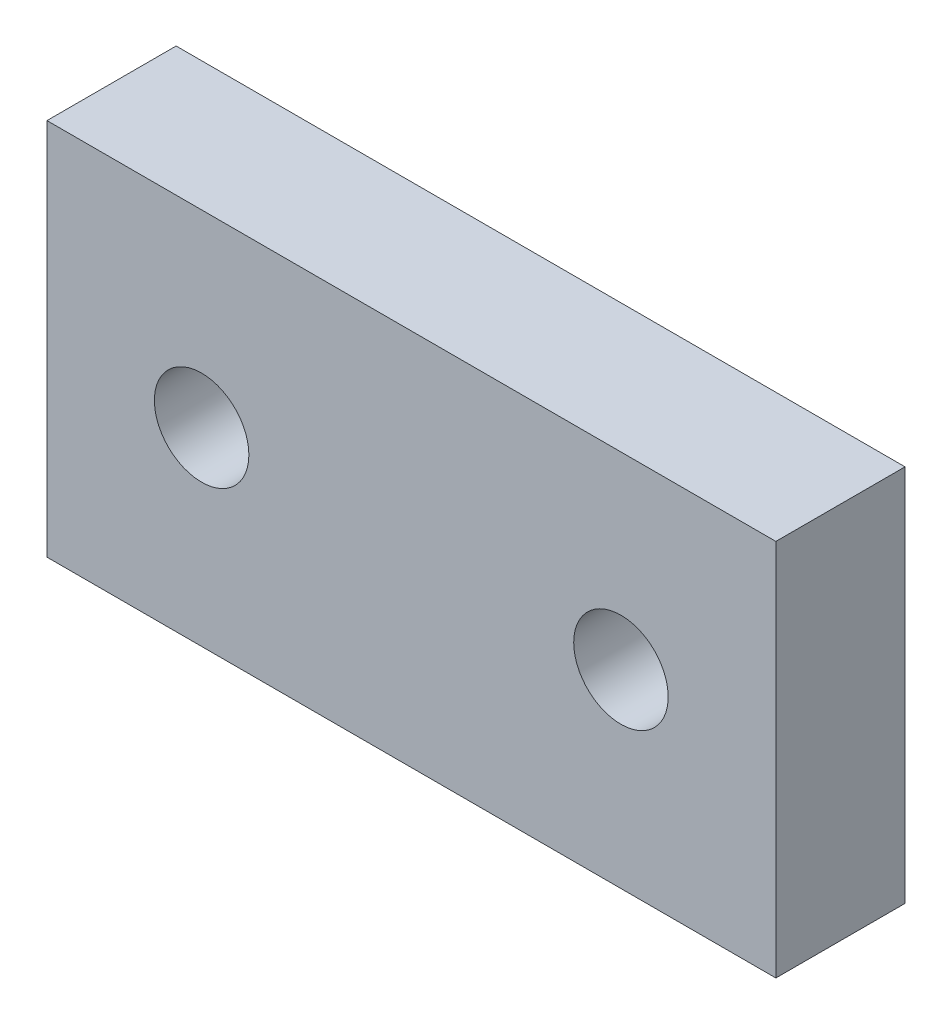
ISO-10303-21;
HEADER;
FILE_DESCRIPTION(('STEP AP214'),'2;1');
FILE_NAME('part.step','',(''),(''),'','','');
FILE_SCHEMA(('AUTOMOTIVE_DESIGN { 1 0 10303 214 1 1 1 1 }'));
ENDSEC;
DATA;
#1=APPLICATION_CONTEXT('core data for automotive mechanical design processes');
#2=APPLICATION_PROTOCOL_DEFINITION('international standard','automotive_design',2000,#1);
#3=PRODUCT_CONTEXT('',#1,'mechanical');
#4=PRODUCT('Part','Part','',(#3));
#5=PRODUCT_RELATED_PRODUCT_CATEGORY('part','',(#4));
#6=PRODUCT_DEFINITION_FORMATION('','',#4);
#7=PRODUCT_DEFINITION_CONTEXT('part definition',#1,'design');
#8=PRODUCT_DEFINITION('design','',#6,#7);
#9=PRODUCT_DEFINITION_SHAPE('','',#8);
#10=(LENGTH_UNIT() NAMED_UNIT(*) SI_UNIT(.MILLI.,.METRE.));
#11=(NAMED_UNIT(*) PLANE_ANGLE_UNIT() SI_UNIT($,.RADIAN.));
#12=(NAMED_UNIT(*) SI_UNIT($,.STERADIAN.) SOLID_ANGLE_UNIT());
#13=UNCERTAINTY_MEASURE_WITH_UNIT(LENGTH_MEASURE(1.E-05),#10,'distance_accuracy_value','');
#14=(GEOMETRIC_REPRESENTATION_CONTEXT(3) GLOBAL_UNCERTAINTY_ASSIGNED_CONTEXT((#13)) GLOBAL_UNIT_ASSIGNED_CONTEXT((#10,
#11,#12)) REPRESENTATION_CONTEXT('',''));
#15=CARTESIAN_POINT('',(0.,0.,0.));
#16=DIRECTION('',(0.,0.,1.));
#17=DIRECTION('',(1.,0.,0.));
#18=AXIS2_PLACEMENT_3D('',#15,#16,#17);
#19=CARTESIAN_POINT('',(0.,0.,3.75882541));
#20=DIRECTION('',(1.,0.,0.));
#21=DIRECTION('',(0.,0.,-1.));
#22=AXIS2_PLACEMENT_3D('',#19,#20,#21);
#23=PLANE('',#22);
#24=DIRECTION('',(0.,-1.,0.));
#25=VECTOR('',#24,1.);
#26=CARTESIAN_POINT('',(0.,0.,0.));
#27=LINE('',#26,#25);
#28=CARTESIAN_POINT('',(0.,11.00313828,0.));
#29=VERTEX_POINT('',#28);
#30=CARTESIAN_POINT('',(0.,0.,0.));
#31=VERTEX_POINT('',#30);
#32=EDGE_CURVE('E111',#29,#31,#27,.T.);
#33=ORIENTED_EDGE('',*,*,#32,.T.);
#34=DIRECTION('',(0.,0.,-1.));
#35=VECTOR('',#34,1.);
#36=CARTESIAN_POINT('',(0.,0.,3.75882541));
#37=LINE('',#36,#35);
#38=CARTESIAN_POINT('',(0.,0.,3.75882541));
#39=VERTEX_POINT('',#38);
#40=EDGE_CURVE('E11',#39,#31,#37,.T.);
#41=ORIENTED_EDGE('',*,*,#40,.F.);
#42=DIRECTION('',(0.,-1.,0.));
#43=VECTOR('',#42,1.);
#44=CARTESIAN_POINT('',(0.,0.,3.75882541));
#45=LINE('',#44,#43);
#46=CARTESIAN_POINT('',(0.,11.00313828,3.75882541));
#47=VERTEX_POINT('',#46);
#48=EDGE_CURVE('E94',#47,#39,#45,.T.);
#49=ORIENTED_EDGE('',*,*,#48,.F.);
#50=DIRECTION('',(0.,0.,-1.));
#51=VECTOR('',#50,1.);
#52=CARTESIAN_POINT('',(0.,11.00313828,3.75882541));
#53=LINE('',#52,#51);
#54=EDGE_CURVE('E107',#47,#29,#53,.T.);
#55=ORIENTED_EDGE('',*,*,#54,.T.);
#56=EDGE_LOOP('',(#33,#41,#49,#55));
#57=FACE_BOUND('',#56,.T.);
#58=ADVANCED_FACE('F42',(#57),#23,.F.);
#59=CARTESIAN_POINT('',(0.,0.,3.75882541));
#60=DIRECTION('',(0.,1.,0.));
#61=DIRECTION('',(0.,0.,1.));
#62=AXIS2_PLACEMENT_3D('',#59,#60,#61);
#63=PLANE('',#62);
#64=DIRECTION('',(1.,0.,0.));
#65=VECTOR('',#64,1.);
#66=CARTESIAN_POINT('',(0.,0.,0.));
#67=LINE('',#66,#65);
#68=CARTESIAN_POINT('',(21.21128765,0.,0.));
#69=VERTEX_POINT('',#68);
#70=EDGE_CURVE('E99',#31,#69,#67,.T.);
#71=ORIENTED_EDGE('',*,*,#70,.T.);
#72=DIRECTION('',(0.,0.,-1.));
#73=VECTOR('',#72,1.);
#74=CARTESIAN_POINT('',(21.21128765,0.,3.75882541));
#75=LINE('',#74,#73);
#76=CARTESIAN_POINT('',(21.21128765,0.,3.75882541));
#77=VERTEX_POINT('',#76);
#78=EDGE_CURVE('E51',#77,#69,#75,.T.);
#79=ORIENTED_EDGE('',*,*,#78,.F.);
#80=DIRECTION('',(1.,0.,0.));
#81=VECTOR('',#80,1.);
#82=CARTESIAN_POINT('',(0.,0.,3.75882541));
#83=LINE('',#82,#81);
#84=EDGE_CURVE('E89',#39,#77,#83,.T.);
#85=ORIENTED_EDGE('',*,*,#84,.F.);
#86=ORIENTED_EDGE('',*,*,#40,.T.);
#87=EDGE_LOOP('',(#71,#79,#85,#86));
#88=FACE_BOUND('',#87,.T.);
#89=ADVANCED_FACE('F98',(#88),#63,.F.);
#90=CARTESIAN_POINT('',(21.21128765,0.,3.75882541));
#91=DIRECTION('',(-1.,0.,0.));
#92=DIRECTION('',(0.,0.,1.));
#93=AXIS2_PLACEMENT_3D('',#90,#91,#92);
#94=PLANE('',#93);
#95=DIRECTION('',(0.,1.,0.));
#96=VECTOR('',#95,1.);
#97=CARTESIAN_POINT('',(21.21128765,0.,0.));
#98=LINE('',#97,#96);
#99=CARTESIAN_POINT('',(21.21128765,11.00313828,0.));
#100=VERTEX_POINT('',#99);
#101=EDGE_CURVE('E76',#69,#100,#98,.T.);
#102=ORIENTED_EDGE('',*,*,#101,.T.);
#103=DIRECTION('',(0.,0.,-1.));
#104=VECTOR('',#103,1.);
#105=CARTESIAN_POINT('',(21.21128765,11.00313828,3.75882541));
#106=LINE('',#105,#104);
#107=CARTESIAN_POINT('',(21.21128765,11.00313828,3.75882541));
#108=VERTEX_POINT('',#107);
#109=EDGE_CURVE('E101',#108,#100,#106,.T.);
#110=ORIENTED_EDGE('',*,*,#109,.F.);
#111=DIRECTION('',(0.,1.,0.));
#112=VECTOR('',#111,1.);
#113=CARTESIAN_POINT('',(21.21128765,0.,3.75882541));
#114=LINE('',#113,#112);
#115=EDGE_CURVE('E92',#77,#108,#114,.T.);
#116=ORIENTED_EDGE('',*,*,#115,.F.);
#117=ORIENTED_EDGE('',*,*,#78,.T.);
#118=EDGE_LOOP('',(#102,#110,#116,#117));
#119=FACE_BOUND('',#118,.T.);
#120=ADVANCED_FACE('F102',(#119),#94,.F.);
#121=CARTESIAN_POINT('',(0.,11.00313828,3.75882541));
#122=DIRECTION('',(0.,-1.,0.));
#123=DIRECTION('',(0.,0.,-1.));
#124=AXIS2_PLACEMENT_3D('',#121,#122,#123);
#125=PLANE('',#124);
#126=DIRECTION('',(-1.,0.,0.));
#127=VECTOR('',#126,1.);
#128=CARTESIAN_POINT('',(0.,11.00313828,0.));
#129=LINE('',#128,#127);
#130=EDGE_CURVE('E82',#100,#29,#129,.T.);
#131=ORIENTED_EDGE('',*,*,#130,.T.);
#132=ORIENTED_EDGE('',*,*,#54,.F.);
#133=DIRECTION('',(-1.,0.,0.));
#134=VECTOR('',#133,1.);
#135=CARTESIAN_POINT('',(0.,11.00313828,3.75882541));
#136=LINE('',#135,#134);
#137=EDGE_CURVE('E59',#108,#47,#136,.T.);
#138=ORIENTED_EDGE('',*,*,#137,.F.);
#139=ORIENTED_EDGE('',*,*,#109,.T.);
#140=EDGE_LOOP('',(#131,#132,#138,#139));
#141=FACE_BOUND('',#140,.T.);
#142=ADVANCED_FACE('F126',(#141),#125,.F.);
#143=CARTESIAN_POINT('',(0.,0.,3.75882541));
#144=DIRECTION('',(0.,0.,-1.));
#145=DIRECTION('',(-1.,0.,0.));
#146=AXIS2_PLACEMENT_3D('',#143,#144,#145);
#147=PLANE('',#146);
#148=CARTESIAN_POINT('',(4.50061561,5.51479595,3.75882541));
#149=DIRECTION('',(0.,0.,1.));
#150=DIRECTION('',(1.,0.,0.));
#151=AXIS2_PLACEMENT_3D('',#148,#149,#150);
#152=CIRCLE('',#151,1.375);
#153=CARTESIAN_POINT('',(5.87561561,5.51479595,3.75882541));
#154=VERTEX_POINT('',#153);
#155=EDGE_CURVE('E142',#154,#154,#152,.T.);
#156=ORIENTED_EDGE('',*,*,#155,.F.);
#157=EDGE_LOOP('',(#156));
#158=FACE_BOUND('',#157,.T.);
#159=CARTESIAN_POINT('',(16.70317329,5.51479595,3.75882541));
#160=DIRECTION('',(0.,0.,1.));
#161=DIRECTION('',(-1.,0.,0.));
#162=AXIS2_PLACEMENT_3D('',#159,#160,#161);
#163=CIRCLE('',#162,1.375);
#164=CARTESIAN_POINT('',(15.32817329,5.51479595,3.75882541));
#165=VERTEX_POINT('',#164);
#166=EDGE_CURVE('E134',#165,#165,#163,.T.);
#167=ORIENTED_EDGE('',*,*,#166,.F.);
#168=EDGE_LOOP('',(#167));
#169=FACE_BOUND('',#168,.T.);
#170=ORIENTED_EDGE('',*,*,#48,.T.);
#171=ORIENTED_EDGE('',*,*,#84,.T.);
#172=ORIENTED_EDGE('',*,*,#115,.T.);
#173=ORIENTED_EDGE('',*,*,#137,.T.);
#174=EDGE_LOOP('',(#170,#171,#172,#173));
#175=FACE_BOUND('',#174,.T.);
#176=ADVANCED_FACE('F90',(#158,#169,#175),#147,.F.);
#177=CARTESIAN_POINT('',(0.,0.,0.));
#178=DIRECTION('',(0.,0.,-1.));
#179=DIRECTION('',(-1.,0.,0.));
#180=AXIS2_PLACEMENT_3D('',#177,#178,#179);
#181=PLANE('',#180);
#182=CARTESIAN_POINT('',(4.50061561,5.51479595,0.));
#183=DIRECTION('',(0.,0.,1.));
#184=DIRECTION('',(1.,0.,0.));
#185=AXIS2_PLACEMENT_3D('',#182,#183,#184);
#186=CIRCLE('',#185,1.375);
#187=CARTESIAN_POINT('',(5.87561561,5.51479595,0.));
#188=VERTEX_POINT('',#187);
#189=EDGE_CURVE('E115',#188,#188,#186,.T.);
#190=ORIENTED_EDGE('',*,*,#189,.T.);
#191=EDGE_LOOP('',(#190));
#192=FACE_BOUND('',#191,.T.);
#193=CARTESIAN_POINT('',(16.70317329,5.51479595,0.));
#194=DIRECTION('',(0.,0.,1.));
#195=DIRECTION('',(-1.,0.,0.));
#196=AXIS2_PLACEMENT_3D('',#193,#194,#195);
#197=CIRCLE('',#196,1.375);
#198=CARTESIAN_POINT('',(15.32817329,5.51479595,0.));
#199=VERTEX_POINT('',#198);
#200=EDGE_CURVE('E138',#199,#199,#197,.T.);
#201=ORIENTED_EDGE('',*,*,#200,.T.);
#202=EDGE_LOOP('',(#201));
#203=FACE_BOUND('',#202,.T.);
#204=ORIENTED_EDGE('',*,*,#32,.F.);
#205=ORIENTED_EDGE('',*,*,#130,.F.);
#206=ORIENTED_EDGE('',*,*,#101,.F.);
#207=ORIENTED_EDGE('',*,*,#70,.F.);
#208=EDGE_LOOP('',(#204,#205,#206,#207));
#209=FACE_BOUND('',#208,.T.);
#210=ADVANCED_FACE('F129',(#192,#203,#209),#181,.T.);
#211=CARTESIAN_POINT('',(16.70317329,5.51479595,0.));
#212=DIRECTION('',(0.,0.,1.));
#213=DIRECTION('',(1.,0.,0.));
#214=AXIS2_PLACEMENT_3D('',#211,#212,#213);
#215=CYLINDRICAL_SURFACE('',#214,1.375);
#216=ORIENTED_EDGE('',*,*,#200,.F.);
#217=EDGE_LOOP('',(#216));
#218=FACE_BOUND('',#217,.T.);
#219=ORIENTED_EDGE('',*,*,#166,.T.);
#220=EDGE_LOOP('',(#219));
#221=FACE_BOUND('',#220,.T.);
#222=ADVANCED_FACE('F156',(#218,#221),#215,.F.);
#223=CARTESIAN_POINT('',(4.50061561,5.51479595,0.));
#224=DIRECTION('',(0.,0.,1.));
#225=DIRECTION('',(1.,0.,0.));
#226=AXIS2_PLACEMENT_3D('',#223,#224,#225);
#227=CYLINDRICAL_SURFACE('',#226,1.375);
#228=ORIENTED_EDGE('',*,*,#189,.F.);
#229=EDGE_LOOP('',(#228));
#230=FACE_BOUND('',#229,.T.);
#231=ORIENTED_EDGE('',*,*,#155,.T.);
#232=EDGE_LOOP('',(#231));
#233=FACE_BOUND('',#232,.T.);
#234=ADVANCED_FACE('F153',(#230,#233),#227,.F.);
#235=CLOSED_SHELL('',(#58,#89,#120,#142,#176,#210,#222,#234));
#236=MANIFOLD_SOLID_BREP('B2',#235);
#237=ADVANCED_BREP_SHAPE_REPRESENTATION('',(#18,#236),#14);
#238=SHAPE_DEFINITION_REPRESENTATION(#9,#237);
ENDSEC;
END-ISO-10303-21;
